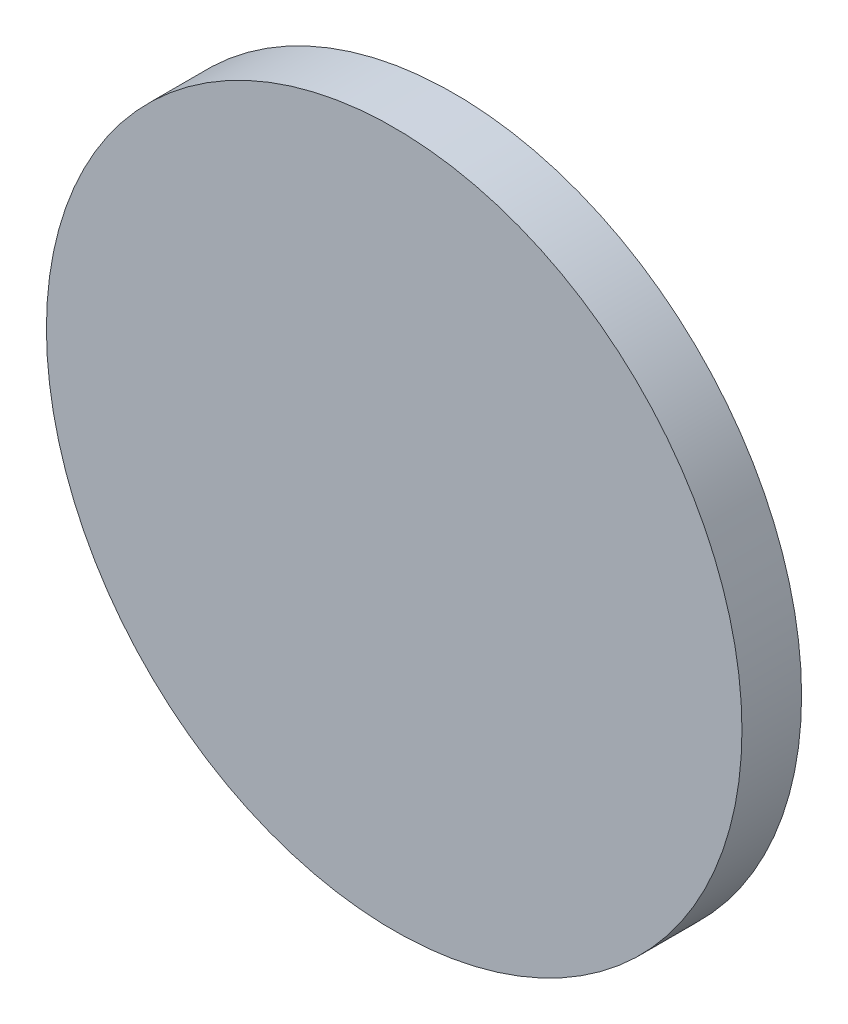
ISO-10303-21;
HEADER;
FILE_DESCRIPTION(('STEP AP214'),'2;1');
FILE_NAME('part.step','',(''),(''),'','','');
FILE_SCHEMA(('AUTOMOTIVE_DESIGN { 1 0 10303 214 1 1 1 1 }'));
ENDSEC;
DATA;
#1=APPLICATION_CONTEXT('core data for automotive mechanical design processes');
#2=APPLICATION_PROTOCOL_DEFINITION('international standard','automotive_design',2000,#1);
#3=PRODUCT_CONTEXT('',#1,'mechanical');
#4=PRODUCT('Part','Part','',(#3));
#5=PRODUCT_RELATED_PRODUCT_CATEGORY('part','',(#4));
#6=PRODUCT_DEFINITION_FORMATION('','',#4);
#7=PRODUCT_DEFINITION_CONTEXT('part definition',#1,'design');
#8=PRODUCT_DEFINITION('design','',#6,#7);
#9=PRODUCT_DEFINITION_SHAPE('','',#8);
#10=(LENGTH_UNIT() NAMED_UNIT(*) SI_UNIT(.MILLI.,.METRE.));
#11=(NAMED_UNIT(*) PLANE_ANGLE_UNIT() SI_UNIT($,.RADIAN.));
#12=(NAMED_UNIT(*) SI_UNIT($,.STERADIAN.) SOLID_ANGLE_UNIT());
#13=UNCERTAINTY_MEASURE_WITH_UNIT(LENGTH_MEASURE(1.E-05),#10,'distance_accuracy_value','');
#14=(GEOMETRIC_REPRESENTATION_CONTEXT(3) GLOBAL_UNCERTAINTY_ASSIGNED_CONTEXT((#13)) GLOBAL_UNIT_ASSIGNED_CONTEXT((#10,
#11,#12)) REPRESENTATION_CONTEXT('',''));
#15=CARTESIAN_POINT('',(0.,0.,0.));
#16=DIRECTION('',(0.,0.,1.));
#17=DIRECTION('',(1.,0.,0.));
#18=AXIS2_PLACEMENT_3D('',#15,#16,#17);
#19=CARTESIAN_POINT('',(11.401,9.241000014875,0.));
#20=DIRECTION('',(0.,0.,-1.));
#21=DIRECTION('',(-1.,0.,0.));
#22=AXIS2_PLACEMENT_3D('',#19,#20,#21);
#23=PLANE('',#22);
#24=CARTESIAN_POINT('',(11.401,9.241000014875,0.));
#25=DIRECTION('',(0.,0.,1.));
#26=DIRECTION('',(1.,0.,0.));
#27=AXIS2_PLACEMENT_3D('',#24,#25,#26);
#28=CIRCLE('',#27,0.200024667);
#29=CARTESIAN_POINT('',(11.601024667,9.241000014875,0.));
#30=VERTEX_POINT('',#29);
#31=EDGE_CURVE('E18',#30,#30,#28,.T.);
#32=ORIENTED_EDGE('',*,*,#31,.F.);
#33=EDGE_LOOP('',(#32));
#34=FACE_BOUND('',#33,.T.);
#35=ADVANCED_FACE('F15',(#34),#23,.T.);
#36=CARTESIAN_POINT('',(11.401,9.241000014875,0.));
#37=DIRECTION('',(0.,0.,1.));
#38=DIRECTION('',(1.,0.,0.));
#39=AXIS2_PLACEMENT_3D('',#36,#37,#38);
#40=CYLINDRICAL_SURFACE('',#39,0.200024667);
#41=CARTESIAN_POINT('',(11.401,9.241000014875,0.03429));
#42=DIRECTION('',(0.,0.,1.));
#43=DIRECTION('',(1.,0.,0.));
#44=AXIS2_PLACEMENT_3D('',#41,#42,#43);
#45=CIRCLE('',#44,0.200024667);
#46=CARTESIAN_POINT('',(11.601024667,9.241000014875,0.03429));
#47=VERTEX_POINT('',#46);
#48=EDGE_CURVE('E10',#47,#47,#45,.T.);
#49=ORIENTED_EDGE('',*,*,#48,.F.);
#50=EDGE_LOOP('',(#49));
#51=FACE_BOUND('',#50,.T.);
#52=ORIENTED_EDGE('',*,*,#31,.T.);
#53=EDGE_LOOP('',(#52));
#54=FACE_BOUND('',#53,.T.);
#55=ADVANCED_FACE('F27',(#51,#54),#40,.T.);
#56=CARTESIAN_POINT('',(11.401,9.241000014875,0.03429));
#57=DIRECTION('',(0.,0.,1.));
#58=DIRECTION('',(1.,0.,0.));
#59=AXIS2_PLACEMENT_3D('',#56,#57,#58);
#60=PLANE('',#59);
#61=ORIENTED_EDGE('',*,*,#48,.T.);
#62=EDGE_LOOP('',(#61));
#63=FACE_BOUND('',#62,.T.);
#64=ADVANCED_FACE('F34',(#63),#60,.T.);
#65=CLOSED_SHELL('',(#35,#55,#64));
#66=MANIFOLD_SOLID_BREP('B1',#65);
#67=ADVANCED_BREP_SHAPE_REPRESENTATION('',(#18,#66),#14);
#68=SHAPE_DEFINITION_REPRESENTATION(#9,#67);
ENDSEC;
END-ISO-10303-21;
